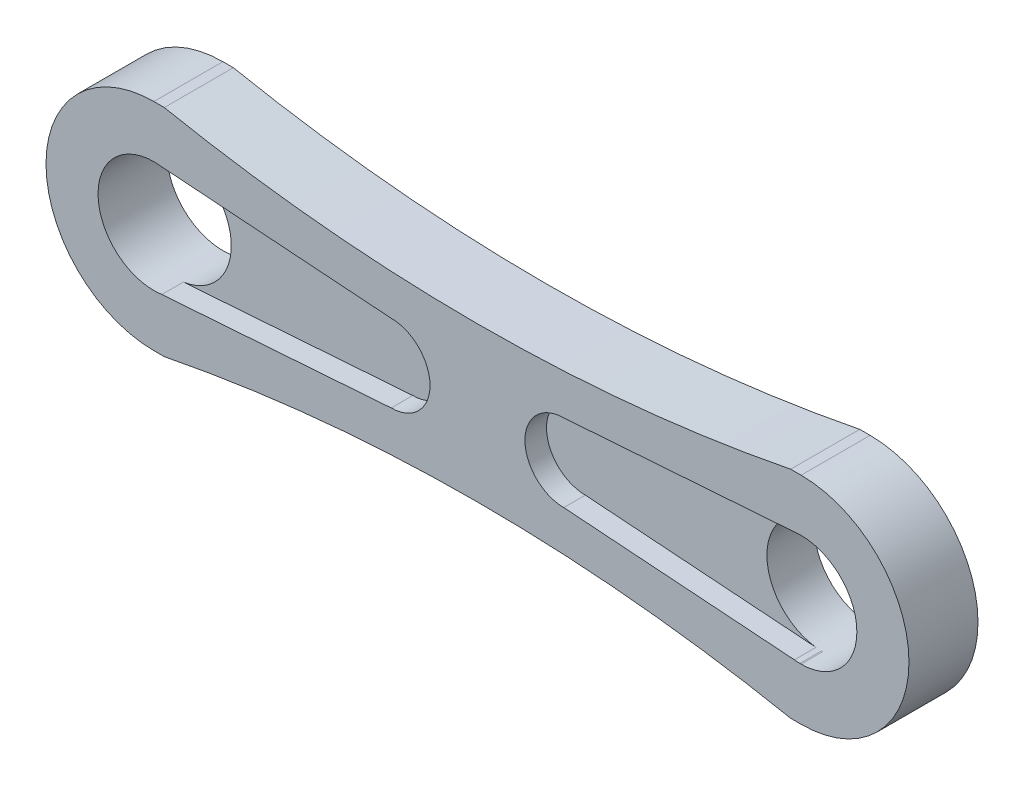
ISO-10303-21;
HEADER;
FILE_DESCRIPTION(('STEP AP214'),'2;1');
FILE_NAME('part.step','',(''),(''),'','','');
FILE_SCHEMA(('AUTOMOTIVE_DESIGN { 1 0 10303 214 1 1 1 1 }'));
ENDSEC;
DATA;
#1=APPLICATION_CONTEXT('core data for automotive mechanical design processes');
#2=APPLICATION_PROTOCOL_DEFINITION('international standard','automotive_design',2000,#1);
#3=PRODUCT_CONTEXT('',#1,'mechanical');
#4=PRODUCT('Part','Part','',(#3));
#5=PRODUCT_RELATED_PRODUCT_CATEGORY('part','',(#4));
#6=PRODUCT_DEFINITION_FORMATION('','',#4);
#7=PRODUCT_DEFINITION_CONTEXT('part definition',#1,'design');
#8=PRODUCT_DEFINITION('design','',#6,#7);
#9=PRODUCT_DEFINITION_SHAPE('','',#8);
#10=(LENGTH_UNIT() NAMED_UNIT(*) SI_UNIT(.MILLI.,.METRE.));
#11=(NAMED_UNIT(*) PLANE_ANGLE_UNIT() SI_UNIT($,.RADIAN.));
#12=(NAMED_UNIT(*) SI_UNIT($,.STERADIAN.) SOLID_ANGLE_UNIT());
#13=UNCERTAINTY_MEASURE_WITH_UNIT(LENGTH_MEASURE(1.E-05),#10,'distance_accuracy_value','');
#14=(GEOMETRIC_REPRESENTATION_CONTEXT(3) GLOBAL_UNCERTAINTY_ASSIGNED_CONTEXT((#13)) GLOBAL_UNIT_ASSIGNED_CONTEXT((#10,
#11,#12)) REPRESENTATION_CONTEXT('',''));
#15=CARTESIAN_POINT('',(0.,0.,0.));
#16=DIRECTION('',(0.,0.,1.));
#17=DIRECTION('',(1.,0.,0.));
#18=AXIS2_PLACEMENT_3D('',#15,#16,#17);
#19=CARTESIAN_POINT('',(0.,-6.35,4.064));
#20=DIRECTION('',(0.,1.,0.));
#21=DIRECTION('',(-1.,0.,0.));
#22=AXIS2_PLACEMENT_3D('',#19,#20,#21);
#23=PLANE('',#22);
#24=DIRECTION('',(0.,0.,1.));
#25=VECTOR('',#24,1.);
#26=CARTESIAN_POINT('',(-18.4373308890278,-6.35000000000001,0.));
#27=LINE('',#26,#25);
#28=CARTESIAN_POINT('',(-18.4373308890278,-6.35000000000001,0.));
#29=VERTEX_POINT('',#28);
#30=CARTESIAN_POINT('',(-18.4373308890278,-6.35000000000001,4.064));
#31=VERTEX_POINT('',#30);
#32=EDGE_CURVE('E53',#29,#31,#27,.T.);
#33=ORIENTED_EDGE('',*,*,#32,.T.);
#34=DIRECTION('',(1.,0.,0.));
#35=VECTOR('',#34,1.);
#36=CARTESIAN_POINT('',(0.,-6.35,4.064));
#37=LINE('',#36,#35);
#38=CARTESIAN_POINT('',(-19.05,-6.35000000000001,4.064));
#39=VERTEX_POINT('',#38);
#40=EDGE_CURVE('E322',#39,#31,#37,.T.);
#41=ORIENTED_EDGE('',*,*,#40,.F.);
#42=DIRECTION('',(0.,0.,-1.));
#43=VECTOR('',#42,1.);
#44=CARTESIAN_POINT('',(-19.05,-6.35000000000001,4.064));
#45=LINE('',#44,#43);
#46=CARTESIAN_POINT('',(-19.05,-6.35000000000001,0.));
#47=VERTEX_POINT('',#46);
#48=EDGE_CURVE('E222',#39,#47,#45,.T.);
#49=ORIENTED_EDGE('',*,*,#48,.T.);
#50=DIRECTION('',(1.,0.,0.));
#51=VECTOR('',#50,1.);
#52=CARTESIAN_POINT('',(0.,-6.35,0.));
#53=LINE('',#52,#51);
#54=EDGE_CURVE('E206',#47,#29,#53,.T.);
#55=ORIENTED_EDGE('',*,*,#54,.T.);
#56=EDGE_LOOP('',(#33,#41,#49,#55));
#57=FACE_BOUND('',#56,.T.);
#58=ADVANCED_FACE('F37',(#57),#23,.F.);
#59=DIRECTION('',(0.,0.,1.));
#60=VECTOR('',#59,1.);
#61=CARTESIAN_POINT('',(18.4373308890277,-6.34999999999998,0.));
#62=LINE('',#61,#60);
#63=CARTESIAN_POINT('',(18.4373308890277,-6.34999999999998,0.));
#64=VERTEX_POINT('',#63);
#65=CARTESIAN_POINT('',(18.4373308890277,-6.34999999999998,4.064));
#66=VERTEX_POINT('',#65);
#67=EDGE_CURVE('E186',#64,#66,#62,.T.);
#68=ORIENTED_EDGE('',*,*,#67,.F.);
#69=CARTESIAN_POINT('',(19.05,-6.34999999999999,0.));
#70=VERTEX_POINT('',#69);
#71=EDGE_CURVE('E197',#64,#70,#53,.T.);
#72=ORIENTED_EDGE('',*,*,#71,.T.);
#73=DIRECTION('',(0.,0.,-1.));
#74=VECTOR('',#73,1.);
#75=CARTESIAN_POINT('',(19.05,-6.34999999999999,4.064));
#76=LINE('',#75,#74);
#77=CARTESIAN_POINT('',(19.05,-6.34999999999999,4.064));
#78=VERTEX_POINT('',#77);
#79=EDGE_CURVE('E219',#78,#70,#76,.T.);
#80=ORIENTED_EDGE('',*,*,#79,.F.);
#81=EDGE_CURVE('E199',#66,#78,#37,.T.);
#82=ORIENTED_EDGE('',*,*,#81,.F.);
#83=EDGE_LOOP('',(#68,#72,#80,#82));
#84=FACE_BOUND('',#83,.T.);
#85=ADVANCED_FACE('F195',(#84),#23,.F.);
#86=CARTESIAN_POINT('',(0.,0.,4.064));
#87=DIRECTION('',(0.,0.,1.));
#88=DIRECTION('',(1.,0.,0.));
#89=AXIS2_PLACEMENT_3D('',#86,#87,#88);
#90=PLANE('',#89);
#91=DIRECTION('',(-0.99744335176781,-0.0714615981783043,0.));
#92=VECTOR('',#91,1.);
#93=CARTESIAN_POINT('',(19.05,3.28687741803236,4.064));
#94=LINE('',#93,#92);
#95=CARTESIAN_POINT('',(19.05,3.28687741803236,4.064));
#96=VERTEX_POINT('',#95);
#97=CARTESIAN_POINT('',(18.9745581086596,3.2814724011808,4.064));
#98=VERTEX_POINT('',#97);
#99=EDGE_CURVE('E287',#96,#98,#94,.T.);
#100=ORIENTED_EDGE('',*,*,#99,.F.);
#101=DIRECTION('',(0.,1.,0.));
#102=VECTOR('',#101,1.);
#103=CARTESIAN_POINT('',(19.05,0.,4.064));
#104=LINE('',#103,#102);
#105=CARTESIAN_POINT('',(19.05,3.28233950082564,4.064));
#106=VERTEX_POINT('',#105);
#107=EDGE_CURVE('E435',#106,#96,#104,.T.);
#108=ORIENTED_EDGE('',*,*,#107,.F.);
#109=CARTESIAN_POINT('',(19.05,0.,4.064));
#110=DIRECTION('',(0.,0.,1.));
#111=DIRECTION('',(1.,0.,0.));
#112=AXIS2_PLACEMENT_3D('',#109,#110,#111);
#113=CIRCLE('',#112,3.28233950082564);
#114=CARTESIAN_POINT('',(19.05,-3.28233950082564,4.064));
#115=VERTEX_POINT('',#114);
#116=EDGE_CURVE('E215',#115,#106,#113,.T.);
#117=ORIENTED_EDGE('',*,*,#116,.F.);
#118=DIRECTION('',(0.,1.,0.));
#119=VECTOR('',#118,1.);
#120=CARTESIAN_POINT('',(19.05,3.28687741803236,4.064));
#121=LINE('',#120,#119);
#122=CARTESIAN_POINT('',(19.05,-3.28687741803236,4.064));
#123=VERTEX_POINT('',#122);
#124=EDGE_CURVE('E290',#123,#115,#121,.T.);
#125=ORIENTED_EDGE('',*,*,#124,.F.);
#126=DIRECTION('',(0.99744335176781,-0.0714615981783043,0.));
#127=VECTOR('',#126,1.);
#128=CARTESIAN_POINT('',(-0.137001215405942,-1.91222915487851,4.064));
#129=LINE('',#128,#127);
#130=CARTESIAN_POINT('',(18.9745581086596,-3.2814724011808,4.064));
#131=VERTEX_POINT('',#130);
#132=EDGE_CURVE('E233',#131,#123,#129,.T.);
#133=ORIENTED_EDGE('',*,*,#132,.F.);
#134=CARTESIAN_POINT('',(18.6568719039876,-3.25871184654397,4.064));
#135=VERTEX_POINT('',#134);
#136=EDGE_CURVE('E354',#135,#131,#113,.T.);
#137=ORIENTED_EDGE('',*,*,#136,.F.);
#138=DIRECTION('',(0.99744335176781,-0.0714615981783043,0.));
#139=VECTOR('',#138,1.);
#140=CARTESIAN_POINT('',(19.05,-3.28687741803236,4.064));
#141=LINE('',#140,#139);
#142=CARTESIAN_POINT('',(5.08,-2.286,4.064));
#143=VERTEX_POINT('',#142);
#144=EDGE_CURVE('E292',#143,#135,#141,.T.);
#145=ORIENTED_EDGE('',*,*,#144,.F.);
#146=CARTESIAN_POINT('',(5.08,0.,4.064));
#147=DIRECTION('',(0.,0.,1.));
#148=DIRECTION('',(-1.,0.,0.));
#149=AXIS2_PLACEMENT_3D('',#146,#147,#148);
#150=CIRCLE('',#149,2.286);
#151=CARTESIAN_POINT('',(5.08,2.286,4.064));
#152=VERTEX_POINT('',#151);
#153=EDGE_CURVE('E294',#152,#143,#150,.T.);
#154=ORIENTED_EDGE('',*,*,#153,.F.);
#155=DIRECTION('',(-0.99744335176781,-0.0714615981783043,0.));
#156=VECTOR('',#155,1.);
#157=CARTESIAN_POINT('',(-0.137001215405942,1.91222915487851,4.064));
#158=LINE('',#157,#156);
#159=CARTESIAN_POINT('',(18.6568719039876,3.25871184654397,4.064));
#160=VERTEX_POINT('',#159);
#161=EDGE_CURVE('E445',#160,#152,#158,.T.);
#162=ORIENTED_EDGE('',*,*,#161,.F.);
#163=EDGE_CURVE('E351',#98,#160,#113,.T.);
#164=ORIENTED_EDGE('',*,*,#163,.F.);
#165=EDGE_LOOP('',(#100,#108,#117,#125,#133,#137,#145,#154,#162,#164));
#166=FACE_BOUND('',#165,.T.);
#167=DIRECTION('',(-0.99744335176781,0.0714615981783043,0.));
#168=VECTOR('',#167,1.);
#169=CARTESIAN_POINT('',(-19.05,3.28687741803236,4.064));
#170=LINE('',#169,#168);
#171=CARTESIAN_POINT('',(-5.08,2.286,4.064));
#172=VERTEX_POINT('',#171);
#173=CARTESIAN_POINT('',(-18.5814300126472,3.25330682969241,4.064));
#174=VERTEX_POINT('',#173);
#175=EDGE_CURVE('E254',#172,#174,#170,.T.);
#176=ORIENTED_EDGE('',*,*,#175,.F.);
#177=CARTESIAN_POINT('',(-5.08,0.,4.064));
#178=DIRECTION('',(0.,0.,1.));
#179=DIRECTION('',(1.,0.,0.));
#180=AXIS2_PLACEMENT_3D('',#177,#178,#179);
#181=CIRCLE('',#180,2.286);
#182=CARTESIAN_POINT('',(-5.08,-2.286,4.064));
#183=VERTEX_POINT('',#182);
#184=EDGE_CURVE('E256',#183,#172,#181,.T.);
#185=ORIENTED_EDGE('',*,*,#184,.F.);
#186=DIRECTION('',(0.99744335176781,0.0714615981783043,0.));
#187=VECTOR('',#186,1.);
#188=CARTESIAN_POINT('',(0.137001215405942,-1.91222915487851,4.064));
#189=LINE('',#188,#187);
#190=CARTESIAN_POINT('',(-18.5814300126472,-3.25330682969241,4.064));
#191=VERTEX_POINT('',#190);
#192=EDGE_CURVE('E227',#191,#183,#189,.T.);
#193=ORIENTED_EDGE('',*,*,#192,.F.);
#194=CARTESIAN_POINT('',(-19.05,0.,4.064));
#195=DIRECTION('',(0.,0.,1.));
#196=DIRECTION('',(1.,0.,0.));
#197=AXIS2_PLACEMENT_3D('',#194,#195,#196);
#198=CIRCLE('',#197,3.28687741803236);
#199=EDGE_CURVE('E349',#174,#191,#198,.T.);
#200=ORIENTED_EDGE('',*,*,#199,.F.);
#201=EDGE_LOOP('',(#176,#185,#193,#200));
#202=FACE_BOUND('',#201,.T.);
#203=ORIENTED_EDGE('',*,*,#40,.T.);
#204=CARTESIAN_POINT('',(0.,-99.4309420818236,4.064));
#205=DIRECTION('',(0.,0.,1.));
#206=DIRECTION('',(1.,0.,0.));
#207=AXIS2_PLACEMENT_3D('',#204,#205,#206);
#208=CIRCLE('',#207,94.8893932383978);
#209=EDGE_CURVE('E191',#31,#66,#208,.F.);
#210=ORIENTED_EDGE('',*,*,#209,.T.);
#211=ORIENTED_EDGE('',*,*,#81,.T.);
#212=CARTESIAN_POINT('',(19.05,0.,4.064));
#213=DIRECTION('',(0.,0.,1.));
#214=DIRECTION('',(1.,0.,0.));
#215=AXIS2_PLACEMENT_3D('',#212,#213,#214);
#216=CIRCLE('',#215,6.34999999999999);
#217=CARTESIAN_POINT('',(19.05,6.34999999999999,4.064));
#218=VERTEX_POINT('',#217);
#219=EDGE_CURVE('E220',#78,#218,#216,.T.);
#220=ORIENTED_EDGE('',*,*,#219,.T.);
#221=DIRECTION('',(1.,0.,0.));
#222=VECTOR('',#221,1.);
#223=CARTESIAN_POINT('',(0.,6.34999999999999,4.064));
#224=LINE('',#223,#222);
#225=CARTESIAN_POINT('',(18.4373308890279,6.34999999999999,4.064));
#226=VERTEX_POINT('',#225);
#227=EDGE_CURVE('E348',#226,#218,#224,.T.);
#228=ORIENTED_EDGE('',*,*,#227,.F.);
#229=CARTESIAN_POINT('',(0.,99.4309420818236,4.064));
#230=DIRECTION('',(0.,0.,1.));
#231=DIRECTION('',(1.,0.,0.));
#232=AXIS2_PLACEMENT_3D('',#229,#230,#231);
#233=CIRCLE('',#232,94.8893932383979);
#234=CARTESIAN_POINT('',(-18.4373308890279,6.34999999999999,4.064));
#235=VERTEX_POINT('',#234);
#236=EDGE_CURVE('E200',#235,#226,#233,.T.);
#237=ORIENTED_EDGE('',*,*,#236,.F.);
#238=CARTESIAN_POINT('',(-19.05,6.34999999999999,4.064));
#239=VERTEX_POINT('',#238);
#240=EDGE_CURVE('E346',#239,#235,#224,.T.);
#241=ORIENTED_EDGE('',*,*,#240,.F.);
#242=CARTESIAN_POINT('',(-19.05,0.,4.064));
#243=DIRECTION('',(0.,0.,1.));
#244=DIRECTION('',(1.,0.,0.));
#245=AXIS2_PLACEMENT_3D('',#242,#243,#244);
#246=CIRCLE('',#245,6.35);
#247=EDGE_CURVE('E344',#239,#39,#246,.T.);
#248=ORIENTED_EDGE('',*,*,#247,.T.);
#249=EDGE_LOOP('',(#203,#210,#211,#220,#228,#237,#241,#248));
#250=FACE_BOUND('',#249,.T.);
#251=ADVANCED_FACE('F318',(#166,#202,#250),#90,.T.);
#252=CARTESIAN_POINT('',(0.,0.,0.));
#253=DIRECTION('',(0.,0.,1.));
#254=DIRECTION('',(1.,0.,0.));
#255=AXIS2_PLACEMENT_3D('',#252,#253,#254);
#256=PLANE('',#255);
#257=CARTESIAN_POINT('',(-19.05,0.,0.));
#258=DIRECTION('',(0.,0.,1.));
#259=DIRECTION('',(1.,0.,0.));
#260=AXIS2_PLACEMENT_3D('',#257,#258,#259);
#261=CIRCLE('',#260,3.28687741803236);
#262=CARTESIAN_POINT('',(-15.7631225819676,0.,0.));
#263=VERTEX_POINT('',#262);
#264=EDGE_CURVE('E335',#263,#263,#261,.T.);
#265=ORIENTED_EDGE('',*,*,#264,.T.);
#266=EDGE_LOOP('',(#265));
#267=FACE_BOUND('',#266,.T.);
#268=CARTESIAN_POINT('',(19.05,0.,0.));
#269=DIRECTION('',(0.,0.,1.));
#270=DIRECTION('',(1.,0.,0.));
#271=AXIS2_PLACEMENT_3D('',#268,#269,#270);
#272=CIRCLE('',#271,3.28233950082564);
#273=CARTESIAN_POINT('',(22.3323395008256,0.,0.));
#274=VERTEX_POINT('',#273);
#275=EDGE_CURVE('E339',#274,#274,#272,.T.);
#276=ORIENTED_EDGE('',*,*,#275,.T.);
#277=EDGE_LOOP('',(#276));
#278=FACE_BOUND('',#277,.T.);
#279=CARTESIAN_POINT('',(0.,-99.4309420818236,0.));
#280=DIRECTION('',(0.,0.,1.));
#281=DIRECTION('',(1.,0.,0.));
#282=AXIS2_PLACEMENT_3D('',#279,#280,#281);
#283=CIRCLE('',#282,94.8893932383978);
#284=EDGE_CURVE('E183',#29,#64,#283,.F.);
#285=ORIENTED_EDGE('',*,*,#284,.F.);
#286=ORIENTED_EDGE('',*,*,#54,.F.);
#287=CARTESIAN_POINT('',(-19.05,0.,0.));
#288=DIRECTION('',(0.,0.,1.));
#289=DIRECTION('',(1.,0.,0.));
#290=AXIS2_PLACEMENT_3D('',#287,#288,#289);
#291=CIRCLE('',#290,6.35);
#292=CARTESIAN_POINT('',(-19.05,6.34999999999999,0.));
#293=VERTEX_POINT('',#292);
#294=EDGE_CURVE('E207',#293,#47,#291,.T.);
#295=ORIENTED_EDGE('',*,*,#294,.F.);
#296=DIRECTION('',(1.,0.,0.));
#297=VECTOR('',#296,1.);
#298=CARTESIAN_POINT('',(0.,6.34999999999999,0.));
#299=LINE('',#298,#297);
#300=CARTESIAN_POINT('',(-18.4373308890279,6.34999999999999,0.));
#301=VERTEX_POINT('',#300);
#302=EDGE_CURVE('E210',#293,#301,#299,.T.);
#303=ORIENTED_EDGE('',*,*,#302,.T.);
#304=CARTESIAN_POINT('',(0.,99.4309420818236,0.));
#305=DIRECTION('',(0.,0.,1.));
#306=DIRECTION('',(1.,0.,0.));
#307=AXIS2_PLACEMENT_3D('',#304,#305,#306);
#308=CIRCLE('',#307,94.8893932383979);
#309=CARTESIAN_POINT('',(18.4373308890279,6.34999999999999,0.));
#310=VERTEX_POINT('',#309);
#311=EDGE_CURVE('E311',#301,#310,#308,.T.);
#312=ORIENTED_EDGE('',*,*,#311,.T.);
#313=CARTESIAN_POINT('',(19.05,6.34999999999999,0.));
#314=VERTEX_POINT('',#313);
#315=EDGE_CURVE('E334',#310,#314,#299,.T.);
#316=ORIENTED_EDGE('',*,*,#315,.T.);
#317=CARTESIAN_POINT('',(19.05,0.,0.));
#318=DIRECTION('',(0.,0.,1.));
#319=DIRECTION('',(1.,0.,0.));
#320=AXIS2_PLACEMENT_3D('',#317,#318,#319);
#321=CIRCLE('',#320,6.34999999999999);
#322=EDGE_CURVE('E204',#70,#314,#321,.T.);
#323=ORIENTED_EDGE('',*,*,#322,.F.);
#324=ORIENTED_EDGE('',*,*,#71,.F.);
#325=EDGE_LOOP('',(#285,#286,#295,#303,#312,#316,#323,#324));
#326=FACE_BOUND('',#325,.T.);
#327=ADVANCED_FACE('F202',(#267,#278,#326),#256,.F.);
#328=CARTESIAN_POINT('',(0.,6.34999999999999,4.064));
#329=DIRECTION('',(0.,1.,0.));
#330=DIRECTION('',(0.,0.,1.));
#331=AXIS2_PLACEMENT_3D('',#328,#329,#330);
#332=PLANE('',#331);
#333=DIRECTION('',(0.,0.,1.));
#334=VECTOR('',#333,1.);
#335=CARTESIAN_POINT('',(-18.4373308890279,6.34999999999999,0.));
#336=LINE('',#335,#334);
#337=EDGE_CURVE('E309',#301,#235,#336,.T.);
#338=ORIENTED_EDGE('',*,*,#337,.F.);
#339=ORIENTED_EDGE('',*,*,#302,.F.);
#340=DIRECTION('',(0.,0.,-1.));
#341=VECTOR('',#340,1.);
#342=CARTESIAN_POINT('',(-19.05,6.34999999999999,4.064));
#343=LINE('',#342,#341);
#344=EDGE_CURVE('E225',#239,#293,#343,.T.);
#345=ORIENTED_EDGE('',*,*,#344,.F.);
#346=ORIENTED_EDGE('',*,*,#240,.T.);
#347=EDGE_LOOP('',(#338,#339,#345,#346));
#348=FACE_BOUND('',#347,.T.);
#349=ADVANCED_FACE('F331',(#348),#332,.T.);
#350=DIRECTION('',(0.,0.,1.));
#351=VECTOR('',#350,1.);
#352=CARTESIAN_POINT('',(18.4373308890279,6.34999999999999,0.));
#353=LINE('',#352,#351);
#354=EDGE_CURVE('E61',#310,#226,#353,.T.);
#355=ORIENTED_EDGE('',*,*,#354,.T.);
#356=ORIENTED_EDGE('',*,*,#227,.T.);
#357=DIRECTION('',(0.,0.,-1.));
#358=VECTOR('',#357,1.);
#359=CARTESIAN_POINT('',(19.05,6.34999999999999,4.064));
#360=LINE('',#359,#358);
#361=EDGE_CURVE('E216',#218,#314,#360,.T.);
#362=ORIENTED_EDGE('',*,*,#361,.T.);
#363=ORIENTED_EDGE('',*,*,#315,.F.);
#364=EDGE_LOOP('',(#355,#356,#362,#363));
#365=FACE_BOUND('',#364,.T.);
#366=ADVANCED_FACE('F402',(#365),#332,.T.);
#367=CARTESIAN_POINT('',(-19.05,0.,4.064));
#368=DIRECTION('',(0.,0.,-1.));
#369=DIRECTION('',(-1.,0.,0.));
#370=AXIS2_PLACEMENT_3D('',#367,#368,#369);
#371=CYLINDRICAL_SURFACE('',#370,6.35);
#372=ORIENTED_EDGE('',*,*,#294,.T.);
#373=ORIENTED_EDGE('',*,*,#48,.F.);
#374=ORIENTED_EDGE('',*,*,#247,.F.);
#375=ORIENTED_EDGE('',*,*,#344,.T.);
#376=EDGE_LOOP('',(#372,#373,#374,#375));
#377=FACE_BOUND('',#376,.T.);
#378=ADVANCED_FACE('F399',(#377),#371,.T.);
#379=CARTESIAN_POINT('',(-19.05,0.,4.064));
#380=DIRECTION('',(0.,0.,-1.));
#381=DIRECTION('',(-1.,0.,0.));
#382=AXIS2_PLACEMENT_3D('',#379,#380,#381);
#383=CYLINDRICAL_SURFACE('',#382,3.28687741803236);
#384=DIRECTION('',(0.,0.,-1.));
#385=VECTOR('',#384,1.);
#386=CARTESIAN_POINT('',(-18.5814300126472,-3.25330682969241,4.064));
#387=LINE('',#386,#385);
#388=CARTESIAN_POINT('',(-18.5814300126472,-3.25330682969241,2.794));
#389=VERTEX_POINT('',#388);
#390=EDGE_CURVE('E240',#389,#191,#387,.F.);
#391=ORIENTED_EDGE('',*,*,#390,.F.);
#392=CARTESIAN_POINT('',(-19.05,0.,2.794));
#393=DIRECTION('',(0.,0.,1.));
#394=DIRECTION('',(1.,0.,0.));
#395=AXIS2_PLACEMENT_3D('',#392,#393,#394);
#396=CIRCLE('',#395,3.28687741803236);
#397=CARTESIAN_POINT('',(-18.5814300126472,3.25330682969241,2.794));
#398=VERTEX_POINT('',#397);
#399=EDGE_CURVE('E229',#389,#398,#396,.T.);
#400=ORIENTED_EDGE('',*,*,#399,.T.);
#401=DIRECTION('',(0.,0.,-1.));
#402=VECTOR('',#401,1.);
#403=CARTESIAN_POINT('',(-18.5814300126472,3.25330682969241,4.064));
#404=LINE('',#403,#402);
#405=EDGE_CURVE('E243',#174,#398,#404,.T.);
#406=ORIENTED_EDGE('',*,*,#405,.F.);
#407=ORIENTED_EDGE('',*,*,#199,.T.);
#408=EDGE_LOOP('',(#391,#400,#406,#407));
#409=FACE_BOUND('',#408,.T.);
#410=ORIENTED_EDGE('',*,*,#264,.F.);
#411=EDGE_LOOP('',(#410));
#412=FACE_BOUND('',#411,.T.);
#413=ADVANCED_FACE('F372',(#409,#412),#383,.F.);
#414=CARTESIAN_POINT('',(19.05,0.,4.064));
#415=DIRECTION('',(0.,0.,-1.));
#416=DIRECTION('',(-1.,0.,0.));
#417=AXIS2_PLACEMENT_3D('',#414,#415,#416);
#418=CYLINDRICAL_SURFACE('',#417,3.28233950082564);
#419=DIRECTION('',(0.,0.,-1.));
#420=VECTOR('',#419,1.);
#421=CARTESIAN_POINT('',(18.9745581086596,3.2814724011808,4.064));
#422=LINE('',#421,#420);
#423=CARTESIAN_POINT('',(18.9745581086596,3.2814724011808,2.794));
#424=VERTEX_POINT('',#423);
#425=EDGE_CURVE('E259',#98,#424,#422,.T.);
#426=ORIENTED_EDGE('',*,*,#425,.F.);
#427=ORIENTED_EDGE('',*,*,#163,.T.);
#428=DIRECTION('',(0.,0.,-1.));
#429=VECTOR('',#428,1.);
#430=CARTESIAN_POINT('',(18.6568719039876,3.25871184654397,4.064));
#431=LINE('',#430,#429);
#432=CARTESIAN_POINT('',(18.6568719039876,3.25871184654397,2.794));
#433=VERTEX_POINT('',#432);
#434=EDGE_CURVE('E264',#433,#160,#431,.F.);
#435=ORIENTED_EDGE('',*,*,#434,.F.);
#436=CARTESIAN_POINT('',(19.05,0.,2.794));
#437=DIRECTION('',(0.,0.,-1.));
#438=DIRECTION('',(-1.,0.,0.));
#439=AXIS2_PLACEMENT_3D('',#436,#437,#438);
#440=CIRCLE('',#439,3.28233950082564);
#441=CARTESIAN_POINT('',(18.6568719039876,-3.25871184654397,2.794));
#442=VERTEX_POINT('',#441);
#443=EDGE_CURVE('E41',#442,#433,#440,.T.);
#444=ORIENTED_EDGE('',*,*,#443,.F.);
#445=DIRECTION('',(0.,0.,-1.));
#446=VECTOR('',#445,1.);
#447=CARTESIAN_POINT('',(18.6568719039876,-3.25871184654397,4.064));
#448=LINE('',#447,#446);
#449=EDGE_CURVE('E270',#135,#442,#448,.T.);
#450=ORIENTED_EDGE('',*,*,#449,.F.);
#451=ORIENTED_EDGE('',*,*,#136,.T.);
#452=DIRECTION('',(0.,0.,-1.));
#453=VECTOR('',#452,1.);
#454=CARTESIAN_POINT('',(18.9745581086596,-3.2814724011808,4.064));
#455=LINE('',#454,#453);
#456=CARTESIAN_POINT('',(18.9745581086596,-3.2814724011808,2.794));
#457=VERTEX_POINT('',#456);
#458=EDGE_CURVE('E272',#457,#131,#455,.F.);
#459=ORIENTED_EDGE('',*,*,#458,.F.);
#460=CARTESIAN_POINT('',(19.05,-3.28233950082564,2.794));
#461=VERTEX_POINT('',#460);
#462=EDGE_CURVE('E46',#461,#457,#440,.T.);
#463=ORIENTED_EDGE('',*,*,#462,.F.);
#464=DIRECTION('',(0.,0.,-1.));
#465=VECTOR('',#464,1.);
#466=CARTESIAN_POINT('',(19.05,-3.28233950082564,4.064));
#467=LINE('',#466,#465);
#468=EDGE_CURVE('E266',#115,#461,#467,.T.);
#469=ORIENTED_EDGE('',*,*,#468,.F.);
#470=ORIENTED_EDGE('',*,*,#116,.T.);
#471=DIRECTION('',(0.,0.,-1.));
#472=VECTOR('',#471,1.);
#473=CARTESIAN_POINT('',(19.05,3.28233950082564,4.064));
#474=LINE('',#473,#472);
#475=CARTESIAN_POINT('',(19.05,3.28233950082564,2.794));
#476=VERTEX_POINT('',#475);
#477=EDGE_CURVE('E268',#476,#106,#474,.F.);
#478=ORIENTED_EDGE('',*,*,#477,.F.);
#479=EDGE_CURVE('E11',#424,#476,#440,.T.);
#480=ORIENTED_EDGE('',*,*,#479,.F.);
#481=EDGE_LOOP('',(#426,#427,#435,#444,#450,#451,#459,#463,#469,#470,#478,#480));
#482=FACE_BOUND('',#481,.T.);
#483=ORIENTED_EDGE('',*,*,#275,.F.);
#484=EDGE_LOOP('',(#483));
#485=FACE_BOUND('',#484,.T.);
#486=ADVANCED_FACE('F39',(#482,#485),#418,.F.);
#487=CARTESIAN_POINT('',(19.05,0.,4.064));
#488=DIRECTION('',(0.,0.,-1.));
#489=DIRECTION('',(-1.,0.,0.));
#490=AXIS2_PLACEMENT_3D('',#487,#488,#489);
#491=CYLINDRICAL_SURFACE('',#490,6.34999999999999);
#492=ORIENTED_EDGE('',*,*,#322,.T.);
#493=ORIENTED_EDGE('',*,*,#361,.F.);
#494=ORIENTED_EDGE('',*,*,#219,.F.);
#495=ORIENTED_EDGE('',*,*,#79,.T.);
#496=EDGE_LOOP('',(#492,#493,#494,#495));
#497=FACE_BOUND('',#496,.T.);
#498=ADVANCED_FACE('F389',(#497),#491,.T.);
#499=CARTESIAN_POINT('',(-19.05,3.28687741803236,2.794));
#500=DIRECTION('',(0.0714615981783043,0.99744335176781,0.));
#501=DIRECTION('',(-0.99744335176781,0.0714615981783043,0.));
#502=AXIS2_PLACEMENT_3D('',#499,#500,#501);
#503=PLANE('',#502);
#504=ORIENTED_EDGE('',*,*,#405,.T.);
#505=DIRECTION('',(-0.99744335176781,0.0714615981783043,0.));
#506=VECTOR('',#505,1.);
#507=CARTESIAN_POINT('',(-19.05,3.28687741803236,2.794));
#508=LINE('',#507,#506);
#509=CARTESIAN_POINT('',(-5.08,2.286,2.794));
#510=VERTEX_POINT('',#509);
#511=EDGE_CURVE('E252',#510,#398,#508,.T.);
#512=ORIENTED_EDGE('',*,*,#511,.F.);
#513=DIRECTION('',(0.,0.,1.));
#514=VECTOR('',#513,1.);
#515=CARTESIAN_POINT('',(-5.08,2.286,2.794));
#516=LINE('',#515,#514);
#517=EDGE_CURVE('E244',#510,#172,#516,.T.);
#518=ORIENTED_EDGE('',*,*,#517,.T.);
#519=ORIENTED_EDGE('',*,*,#175,.T.);
#520=EDGE_LOOP('',(#504,#512,#518,#519));
#521=FACE_BOUND('',#520,.T.);
#522=ADVANCED_FACE('F363',(#521),#503,.F.);
#523=CARTESIAN_POINT('',(-5.08,0.,2.794));
#524=DIRECTION('',(0.,0.,1.));
#525=DIRECTION('',(1.,0.,0.));
#526=AXIS2_PLACEMENT_3D('',#523,#524,#525);
#527=CYLINDRICAL_SURFACE('',#526,2.286);
#528=ORIENTED_EDGE('',*,*,#184,.T.);
#529=ORIENTED_EDGE('',*,*,#517,.F.);
#530=CARTESIAN_POINT('',(-5.08,0.,2.794));
#531=DIRECTION('',(0.,0.,1.));
#532=DIRECTION('',(1.,0.,0.));
#533=AXIS2_PLACEMENT_3D('',#530,#531,#532);
#534=CIRCLE('',#533,2.286);
#535=CARTESIAN_POINT('',(-5.08,-2.286,2.794));
#536=VERTEX_POINT('',#535);
#537=EDGE_CURVE('E260',#536,#510,#534,.T.);
#538=ORIENTED_EDGE('',*,*,#537,.F.);
#539=DIRECTION('',(0.,0.,1.));
#540=VECTOR('',#539,1.);
#541=CARTESIAN_POINT('',(-5.08,-2.286,2.794));
#542=LINE('',#541,#540);
#543=EDGE_CURVE('E249',#536,#183,#542,.T.);
#544=ORIENTED_EDGE('',*,*,#543,.T.);
#545=EDGE_LOOP('',(#528,#529,#538,#544));
#546=FACE_BOUND('',#545,.T.);
#547=ADVANCED_FACE('F381',(#546),#527,.F.);
#548=CARTESIAN_POINT('',(-19.05,-3.28687741803236,2.794));
#549=DIRECTION('',(0.0714615981783043,-0.99744335176781,0.));
#550=DIRECTION('',(0.99744335176781,0.0714615981783043,0.));
#551=AXIS2_PLACEMENT_3D('',#548,#549,#550);
#552=PLANE('',#551);
#553=ORIENTED_EDGE('',*,*,#390,.T.);
#554=ORIENTED_EDGE('',*,*,#192,.T.);
#555=ORIENTED_EDGE('',*,*,#543,.F.);
#556=DIRECTION('',(0.99744335176781,0.0714615981783043,0.));
#557=VECTOR('',#556,1.);
#558=CARTESIAN_POINT('',(-19.05,-3.28687741803236,2.794));
#559=LINE('',#558,#557);
#560=EDGE_CURVE('E245',#389,#536,#559,.T.);
#561=ORIENTED_EDGE('',*,*,#560,.F.);
#562=EDGE_LOOP('',(#553,#554,#555,#561));
#563=FACE_BOUND('',#562,.T.);
#564=ADVANCED_FACE('F376',(#563),#552,.F.);
#565=CARTESIAN_POINT('',(-5.08,0.,2.794));
#566=DIRECTION('',(0.,0.,1.));
#567=DIRECTION('',(1.,0.,0.));
#568=AXIS2_PLACEMENT_3D('',#565,#566,#567);
#569=PLANE('',#568);
#570=ORIENTED_EDGE('',*,*,#560,.T.);
#571=ORIENTED_EDGE('',*,*,#537,.T.);
#572=ORIENTED_EDGE('',*,*,#511,.T.);
#573=ORIENTED_EDGE('',*,*,#399,.F.);
#574=EDGE_LOOP('',(#570,#571,#572,#573));
#575=FACE_BOUND('',#574,.T.);
#576=ADVANCED_FACE('F368',(#575),#569,.T.);
#577=CARTESIAN_POINT('',(19.05,-3.28687741803236,2.794));
#578=DIRECTION('',(-0.0714615981783043,-0.99744335176781,0.));
#579=DIRECTION('',(0.99744335176781,-0.0714615981783043,0.));
#580=AXIS2_PLACEMENT_3D('',#577,#578,#579);
#581=PLANE('',#580);
#582=ORIENTED_EDGE('',*,*,#458,.T.);
#583=ORIENTED_EDGE('',*,*,#132,.T.);
#584=DIRECTION('',(0.,0.,1.));
#585=VECTOR('',#584,1.);
#586=CARTESIAN_POINT('',(19.05,-3.28687741803236,2.794));
#587=LINE('',#586,#585);
#588=CARTESIAN_POINT('',(19.05,-3.28687741803236,2.794));
#589=VERTEX_POINT('',#588);
#590=EDGE_CURVE('E278',#589,#123,#587,.T.);
#591=ORIENTED_EDGE('',*,*,#590,.F.);
#592=DIRECTION('',(0.99744335176781,-0.0714615981783043,0.));
#593=VECTOR('',#592,1.);
#594=CARTESIAN_POINT('',(19.05,-3.28687741803236,2.794));
#595=LINE('',#594,#593);
#596=EDGE_CURVE('E306',#457,#589,#595,.T.);
#597=ORIENTED_EDGE('',*,*,#596,.F.);
#598=EDGE_LOOP('',(#582,#583,#591,#597));
#599=FACE_BOUND('',#598,.T.);
#600=ADVANCED_FACE('F451',(#599),#581,.F.);
#601=CARTESIAN_POINT('',(19.05,3.28687741803236,2.794));
#602=DIRECTION('',(1.,0.,0.));
#603=DIRECTION('',(0.,0.,-1.));
#604=AXIS2_PLACEMENT_3D('',#601,#602,#603);
#605=PLANE('',#604);
#606=ORIENTED_EDGE('',*,*,#468,.T.);
#607=DIRECTION('',(0.,1.,0.));
#608=VECTOR('',#607,1.);
#609=CARTESIAN_POINT('',(19.05,3.28687741803236,2.794));
#610=LINE('',#609,#608);
#611=EDGE_CURVE('E299',#589,#461,#610,.T.);
#612=ORIENTED_EDGE('',*,*,#611,.F.);
#613=ORIENTED_EDGE('',*,*,#590,.T.);
#614=ORIENTED_EDGE('',*,*,#124,.T.);
#615=EDGE_LOOP('',(#606,#612,#613,#614));
#616=FACE_BOUND('',#615,.T.);
#617=ADVANCED_FACE('F459',(#616),#605,.F.);
#618=CARTESIAN_POINT('',(5.08,0.,2.794));
#619=DIRECTION('',(0.,0.,-1.));
#620=DIRECTION('',(-1.,0.,0.));
#621=AXIS2_PLACEMENT_3D('',#618,#619,#620);
#622=PLANE('',#621);
#623=ORIENTED_EDGE('',*,*,#462,.T.);
#624=ORIENTED_EDGE('',*,*,#596,.T.);
#625=ORIENTED_EDGE('',*,*,#611,.T.);
#626=EDGE_LOOP('',(#623,#624,#625));
#627=FACE_BOUND('',#626,.T.);
#628=ADVANCED_FACE('F463',(#627),#622,.F.);
#629=ORIENTED_EDGE('',*,*,#449,.T.);
#630=CARTESIAN_POINT('',(5.08,-2.286,2.794));
#631=VERTEX_POINT('',#630);
#632=EDGE_CURVE('E303',#631,#442,#595,.T.);
#633=ORIENTED_EDGE('',*,*,#632,.F.);
#634=DIRECTION('',(0.,0.,1.));
#635=VECTOR('',#634,1.);
#636=CARTESIAN_POINT('',(5.08,-2.286,2.794));
#637=LINE('',#636,#635);
#638=EDGE_CURVE('E275',#631,#143,#637,.T.);
#639=ORIENTED_EDGE('',*,*,#638,.T.);
#640=ORIENTED_EDGE('',*,*,#144,.T.);
#641=EDGE_LOOP('',(#629,#633,#639,#640));
#642=FACE_BOUND('',#641,.T.);
#643=ADVANCED_FACE('F476',(#642),#581,.F.);
#644=CARTESIAN_POINT('',(19.05,3.28687741803236,2.794));
#645=DIRECTION('',(-0.0714615981783043,0.99744335176781,0.));
#646=DIRECTION('',(-0.99744335176781,-0.0714615981783043,0.));
#647=AXIS2_PLACEMENT_3D('',#644,#645,#646);
#648=PLANE('',#647);
#649=ORIENTED_EDGE('',*,*,#434,.T.);
#650=ORIENTED_EDGE('',*,*,#161,.T.);
#651=DIRECTION('',(0.,0.,1.));
#652=VECTOR('',#651,1.);
#653=CARTESIAN_POINT('',(5.08,2.286,2.794));
#654=LINE('',#653,#652);
#655=CARTESIAN_POINT('',(5.08,2.286,2.794));
#656=VERTEX_POINT('',#655);
#657=EDGE_CURVE('E274',#656,#152,#654,.T.);
#658=ORIENTED_EDGE('',*,*,#657,.F.);
#659=DIRECTION('',(-0.99744335176781,-0.0714615981783043,0.));
#660=VECTOR('',#659,1.);
#661=CARTESIAN_POINT('',(19.05,3.28687741803236,2.794));
#662=LINE('',#661,#660);
#663=EDGE_CURVE('E298',#433,#656,#662,.T.);
#664=ORIENTED_EDGE('',*,*,#663,.F.);
#665=EDGE_LOOP('',(#649,#650,#658,#664));
#666=FACE_BOUND('',#665,.T.);
#667=ADVANCED_FACE('F469',(#666),#648,.F.);
#668=CARTESIAN_POINT('',(5.08,0.,2.794));
#669=DIRECTION('',(0.,0.,1.));
#670=DIRECTION('',(1.,0.,0.));
#671=AXIS2_PLACEMENT_3D('',#668,#669,#670);
#672=CYLINDRICAL_SURFACE('',#671,2.286);
#673=ORIENTED_EDGE('',*,*,#153,.T.);
#674=ORIENTED_EDGE('',*,*,#638,.F.);
#675=CARTESIAN_POINT('',(5.08,0.,2.794));
#676=DIRECTION('',(0.,0.,1.));
#677=DIRECTION('',(-1.,0.,0.));
#678=AXIS2_PLACEMENT_3D('',#675,#676,#677);
#679=CIRCLE('',#678,2.286);
#680=EDGE_CURVE('E289',#656,#631,#679,.T.);
#681=ORIENTED_EDGE('',*,*,#680,.F.);
#682=ORIENTED_EDGE('',*,*,#657,.T.);
#683=EDGE_LOOP('',(#673,#674,#681,#682));
#684=FACE_BOUND('',#683,.T.);
#685=ADVANCED_FACE('F472',(#684),#672,.F.);
#686=ORIENTED_EDGE('',*,*,#443,.T.);
#687=ORIENTED_EDGE('',*,*,#663,.T.);
#688=ORIENTED_EDGE('',*,*,#680,.T.);
#689=ORIENTED_EDGE('',*,*,#632,.T.);
#690=EDGE_LOOP('',(#686,#687,#688,#689));
#691=FACE_BOUND('',#690,.T.);
#692=ADVANCED_FACE('F478',(#691),#622,.F.);
#693=ORIENTED_EDGE('',*,*,#479,.T.);
#694=CARTESIAN_POINT('',(19.05,3.28687741803236,2.794));
#695=VERTEX_POINT('',#694);
#696=EDGE_CURVE('E302',#476,#695,#610,.T.);
#697=ORIENTED_EDGE('',*,*,#696,.T.);
#698=EDGE_CURVE('E279',#695,#424,#662,.T.);
#699=ORIENTED_EDGE('',*,*,#698,.T.);
#700=EDGE_LOOP('',(#693,#697,#699));
#701=FACE_BOUND('',#700,.T.);
#702=ADVANCED_FACE('F480',(#701),#622,.F.);
#703=ORIENTED_EDGE('',*,*,#425,.T.);
#704=ORIENTED_EDGE('',*,*,#698,.F.);
#705=DIRECTION('',(0.,0.,1.));
#706=VECTOR('',#705,1.);
#707=CARTESIAN_POINT('',(19.05,3.28687741803236,2.794));
#708=LINE('',#707,#706);
#709=EDGE_CURVE('E282',#695,#96,#708,.T.);
#710=ORIENTED_EDGE('',*,*,#709,.T.);
#711=ORIENTED_EDGE('',*,*,#99,.T.);
#712=EDGE_LOOP('',(#703,#704,#710,#711));
#713=FACE_BOUND('',#712,.T.);
#714=ADVANCED_FACE('F438',(#713),#648,.F.);
#715=ORIENTED_EDGE('',*,*,#477,.T.);
#716=ORIENTED_EDGE('',*,*,#107,.T.);
#717=ORIENTED_EDGE('',*,*,#709,.F.);
#718=ORIENTED_EDGE('',*,*,#696,.F.);
#719=EDGE_LOOP('',(#715,#716,#717,#718));
#720=FACE_BOUND('',#719,.T.);
#721=ADVANCED_FACE('F443',(#720),#605,.F.);
#722=CARTESIAN_POINT('',(0.,99.4309420818236,0.));
#723=DIRECTION('',(0.,0.,1.));
#724=DIRECTION('',(1.,0.,0.));
#725=AXIS2_PLACEMENT_3D('',#722,#723,#724);
#726=CYLINDRICAL_SURFACE('',#725,94.8893932383979);
#727=ORIENTED_EDGE('',*,*,#236,.T.);
#728=ORIENTED_EDGE('',*,*,#354,.F.);
#729=ORIENTED_EDGE('',*,*,#311,.F.);
#730=ORIENTED_EDGE('',*,*,#337,.T.);
#731=EDGE_LOOP('',(#727,#728,#729,#730));
#732=FACE_BOUND('',#731,.T.);
#733=ADVANCED_FACE('F501',(#732),#726,.F.);
#734=CARTESIAN_POINT('',(0.,-99.4309420818236,0.));
#735=DIRECTION('',(0.,0.,1.));
#736=DIRECTION('',(1.,0.,0.));
#737=AXIS2_PLACEMENT_3D('',#734,#735,#736);
#738=CYLINDRICAL_SURFACE('',#737,94.8893932383978);
#739=ORIENTED_EDGE('',*,*,#209,.F.);
#740=ORIENTED_EDGE('',*,*,#32,.F.);
#741=ORIENTED_EDGE('',*,*,#284,.T.);
#742=ORIENTED_EDGE('',*,*,#67,.T.);
#743=EDGE_LOOP('',(#739,#740,#741,#742));
#744=FACE_BOUND('',#743,.T.);
#745=ADVANCED_FACE('F185',(#744),#738,.F.);
#746=CLOSED_SHELL('',(#58,#85,#251,#327,#349,#366,#378,#413,#486,#498,#522,#547,#564,#576,#600,
#617,#628,#643,#667,#685,#692,#702,#714,#721,#733,#745));
#747=MANIFOLD_SOLID_BREP('B2',#746);
#748=ADVANCED_BREP_SHAPE_REPRESENTATION('',(#18,#747),#14);
#749=SHAPE_DEFINITION_REPRESENTATION(#9,#748);
ENDSEC;
END-ISO-10303-21;
